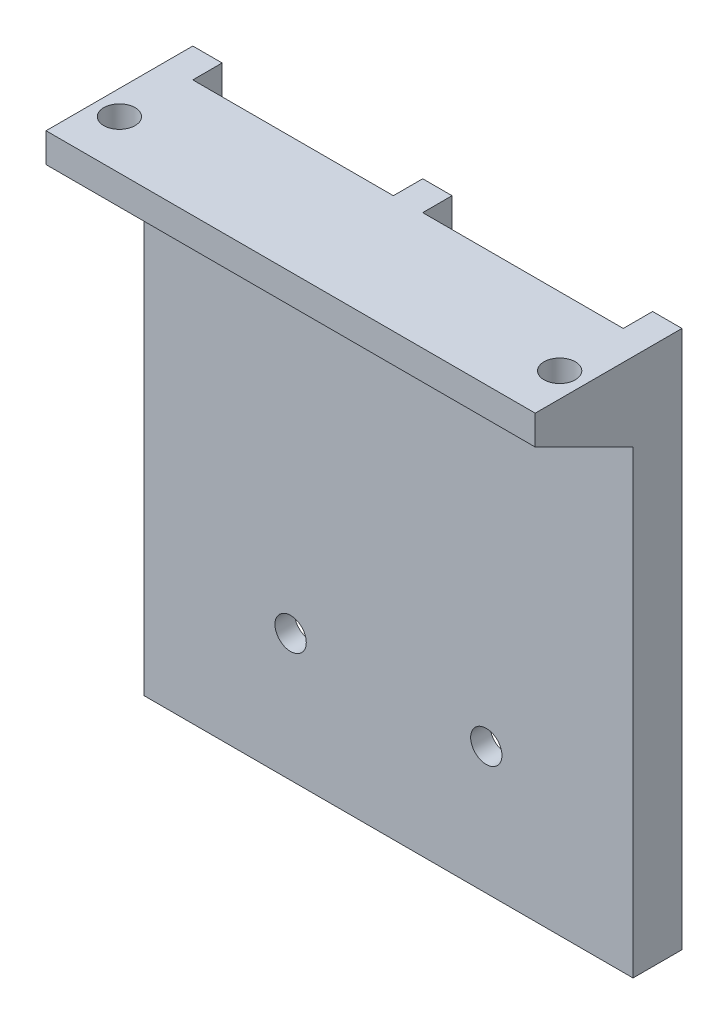
ISO-10303-21;
HEADER;
FILE_DESCRIPTION(('STEP AP214'),'2;1');
FILE_NAME('part.step','',(''),(''),'','','');
FILE_SCHEMA(('AUTOMOTIVE_DESIGN { 1 0 10303 214 1 1 1 1 }'));
ENDSEC;
DATA;
#1=APPLICATION_CONTEXT('core data for automotive mechanical design processes');
#2=APPLICATION_PROTOCOL_DEFINITION('international standard','automotive_design',2000,#1);
#3=PRODUCT_CONTEXT('',#1,'mechanical');
#4=PRODUCT('Part','Part','',(#3));
#5=PRODUCT_RELATED_PRODUCT_CATEGORY('part','',(#4));
#6=PRODUCT_DEFINITION_FORMATION('','',#4);
#7=PRODUCT_DEFINITION_CONTEXT('part definition',#1,'design');
#8=PRODUCT_DEFINITION('design','',#6,#7);
#9=PRODUCT_DEFINITION_SHAPE('','',#8);
#10=(LENGTH_UNIT() NAMED_UNIT(*) SI_UNIT(.MILLI.,.METRE.));
#11=(NAMED_UNIT(*) PLANE_ANGLE_UNIT() SI_UNIT($,.RADIAN.));
#12=(NAMED_UNIT(*) SI_UNIT($,.STERADIAN.) SOLID_ANGLE_UNIT());
#13=UNCERTAINTY_MEASURE_WITH_UNIT(LENGTH_MEASURE(1.E-05),#10,'distance_accuracy_value','');
#14=(GEOMETRIC_REPRESENTATION_CONTEXT(3) GLOBAL_UNCERTAINTY_ASSIGNED_CONTEXT((#13)) GLOBAL_UNIT_ASSIGNED_CONTEXT((#10,
#11,#12)) REPRESENTATION_CONTEXT('',''));
#15=CARTESIAN_POINT('',(0.,0.,0.));
#16=DIRECTION('',(0.,0.,1.));
#17=DIRECTION('',(1.,0.,0.));
#18=AXIS2_PLACEMENT_3D('',#15,#16,#17);
#19=CARTESIAN_POINT('',(0.,0.,-2.));
#20=DIRECTION('',(0.,0.,1.));
#21=DIRECTION('',(1.,0.,0.));
#22=AXIS2_PLACEMENT_3D('',#19,#20,#21);
#23=PLANE('',#22);
#24=CARTESIAN_POINT('',(10.,-46.9514892093612,-2.));
#25=DIRECTION('',(0.,0.,1.));
#26=DIRECTION('',(1.,0.,0.));
#27=AXIS2_PLACEMENT_3D('',#24,#25,#26);
#28=CIRCLE('',#27,1.6);
#29=CARTESIAN_POINT('',(11.6,-46.9514892093612,-2.));
#30=VERTEX_POINT('',#29);
#31=EDGE_CURVE('E251',#30,#30,#28,.T.);
#32=ORIENTED_EDGE('',*,*,#31,.T.);
#33=EDGE_LOOP('',(#32));
#34=FACE_BOUND('',#33,.T.);
#35=DIRECTION('',(0.,1.,0.));
#36=VECTOR('',#35,1.);
#37=CARTESIAN_POINT('',(22.,-59.9514892093612,-2.));
#38=LINE('',#37,#36);
#39=CARTESIAN_POINT('',(22.,-59.9514892093612,-2.));
#40=VERTEX_POINT('',#39);
#41=CARTESIAN_POINT('',(22.,-4.95148920936116,-2.));
#42=VERTEX_POINT('',#41);
#43=EDGE_CURVE('E49',#40,#42,#38,.T.);
#44=ORIENTED_EDGE('',*,*,#43,.F.);
#45=DIRECTION('',(1.,0.,0.));
#46=VECTOR('',#45,1.);
#47=CARTESIAN_POINT('',(-25.,-59.9514892093612,-2.));
#48=LINE('',#47,#46);
#49=CARTESIAN_POINT('',(1.5,-59.9514892093612,-2.));
#50=VERTEX_POINT('',#49);
#51=EDGE_CURVE('E258',#50,#40,#48,.T.);
#52=ORIENTED_EDGE('',*,*,#51,.F.);
#53=DIRECTION('',(0.,1.,0.));
#54=VECTOR('',#53,1.);
#55=CARTESIAN_POINT('',(1.5,0.,-2.));
#56=LINE('',#55,#54);
#57=CARTESIAN_POINT('',(1.5,-4.95148920936116,-2.));
#58=VERTEX_POINT('',#57);
#59=EDGE_CURVE('E134',#50,#58,#56,.T.);
#60=ORIENTED_EDGE('',*,*,#59,.T.);
#61=DIRECTION('',(-1.,0.,0.));
#62=VECTOR('',#61,1.);
#63=CARTESIAN_POINT('',(0.,-4.95148920936116,-2.));
#64=LINE('',#63,#62);
#65=EDGE_CURVE('E132',#42,#58,#64,.T.);
#66=ORIENTED_EDGE('',*,*,#65,.F.);
#67=EDGE_LOOP('',(#44,#52,#60,#66));
#68=FACE_BOUND('',#67,.T.);
#69=ADVANCED_FACE('F32',(#34,#68),#23,.F.);
#70=CARTESIAN_POINT('',(-10.,-46.9514892093612,-2.));
#71=DIRECTION('',(0.,0.,1.));
#72=DIRECTION('',(1.,0.,0.));
#73=AXIS2_PLACEMENT_3D('',#70,#71,#72);
#74=CIRCLE('',#73,1.6);
#75=CARTESIAN_POINT('',(-8.4,-46.9514892093612,-2.));
#76=VERTEX_POINT('',#75);
#77=EDGE_CURVE('E245',#76,#76,#74,.T.);
#78=ORIENTED_EDGE('',*,*,#77,.T.);
#79=EDGE_LOOP('',(#78));
#80=FACE_BOUND('',#79,.T.);
#81=CARTESIAN_POINT('',(-22.,-59.9514892093612,-2.));
#82=VERTEX_POINT('',#81);
#83=CARTESIAN_POINT('',(-1.5,-59.9514892093612,-2.));
#84=VERTEX_POINT('',#83);
#85=EDGE_CURVE('E257',#82,#84,#48,.T.);
#86=ORIENTED_EDGE('',*,*,#85,.F.);
#87=DIRECTION('',(0.,1.,0.));
#88=VECTOR('',#87,1.);
#89=CARTESIAN_POINT('',(-22.,0.,-2.));
#90=LINE('',#89,#88);
#91=CARTESIAN_POINT('',(-22.,-4.95148920936116,-2.));
#92=VERTEX_POINT('',#91);
#93=EDGE_CURVE('E57',#82,#92,#90,.T.);
#94=ORIENTED_EDGE('',*,*,#93,.T.);
#95=CARTESIAN_POINT('',(-1.5,-4.95148920936116,-2.));
#96=VERTEX_POINT('',#95);
#97=EDGE_CURVE('E140',#96,#92,#64,.T.);
#98=ORIENTED_EDGE('',*,*,#97,.F.);
#99=DIRECTION('',(0.,1.,0.));
#100=VECTOR('',#99,1.);
#101=CARTESIAN_POINT('',(-1.5,0.,-2.));
#102=LINE('',#101,#100);
#103=EDGE_CURVE('E186',#84,#96,#102,.T.);
#104=ORIENTED_EDGE('',*,*,#103,.F.);
#105=EDGE_LOOP('',(#86,#94,#98,#104));
#106=FACE_BOUND('',#105,.T.);
#107=ADVANCED_FACE('F306',(#80,#106),#23,.F.);
#108=CARTESIAN_POINT('',(-25.,-59.9514892093612,-2.));
#109=DIRECTION('',(-1.,0.,0.));
#110=DIRECTION('',(0.,0.,1.));
#111=AXIS2_PLACEMENT_3D('',#108,#109,#110);
#112=PLANE('',#111);
#113=DIRECTION('',(0.,-1.,0.));
#114=VECTOR('',#113,1.);
#115=CARTESIAN_POINT('',(-25.,-59.9514892093612,0.));
#116=LINE('',#115,#114);
#117=CARTESIAN_POINT('',(-25.,-12.9514892093612,0.));
#118=VERTEX_POINT('',#117);
#119=CARTESIAN_POINT('',(-25.,-59.9514892093612,0.));
#120=VERTEX_POINT('',#119);
#121=EDGE_CURVE('E254',#118,#120,#116,.T.);
#122=ORIENTED_EDGE('',*,*,#121,.F.);
#123=DIRECTION('',(0.,-0.447213595499958,-0.894427190999916));
#124=VECTOR('',#123,1.);
#125=CARTESIAN_POINT('',(-25.,-7.95148920936116,10.));
#126=LINE('',#125,#124);
#127=CARTESIAN_POINT('',(-25.,-7.95148920936116,10.));
#128=VERTEX_POINT('',#127);
#129=EDGE_CURVE('E226',#128,#118,#126,.T.);
#130=ORIENTED_EDGE('',*,*,#129,.F.);
#131=DIRECTION('',(0.,-1.,0.));
#132=VECTOR('',#131,1.);
#133=CARTESIAN_POINT('',(-25.,-4.95148920936116,10.));
#134=LINE('',#133,#132);
#135=CARTESIAN_POINT('',(-25.,-4.95148920936116,10.));
#136=VERTEX_POINT('',#135);
#137=EDGE_CURVE('E235',#136,#128,#134,.T.);
#138=ORIENTED_EDGE('',*,*,#137,.F.);
#139=DIRECTION('',(0.,0.,1.));
#140=VECTOR('',#139,1.);
#141=CARTESIAN_POINT('',(-25.,-4.95148920936116,-2.));
#142=LINE('',#141,#140);
#143=CARTESIAN_POINT('',(-25.,-4.95148920936116,-5.));
#144=VERTEX_POINT('',#143);
#145=EDGE_CURVE('E11',#144,#136,#142,.T.);
#146=ORIENTED_EDGE('',*,*,#145,.F.);
#147=DIRECTION('',(0.,1.,0.));
#148=VECTOR('',#147,1.);
#149=CARTESIAN_POINT('',(-25.,0.,-5.));
#150=LINE('',#149,#148);
#151=CARTESIAN_POINT('',(-25.,-59.9514892093612,-5.));
#152=VERTEX_POINT('',#151);
#153=EDGE_CURVE('E174',#152,#144,#150,.T.);
#154=ORIENTED_EDGE('',*,*,#153,.F.);
#155=DIRECTION('',(0.,0.,1.));
#156=VECTOR('',#155,1.);
#157=CARTESIAN_POINT('',(-25.,-59.9514892093612,-2.));
#158=LINE('',#157,#156);
#159=EDGE_CURVE('E139',#152,#120,#158,.T.);
#160=ORIENTED_EDGE('',*,*,#159,.T.);
#161=EDGE_LOOP('',(#122,#130,#138,#146,#154,#160));
#162=FACE_BOUND('',#161,.T.);
#163=ADVANCED_FACE('F34',(#162),#112,.T.);
#164=CARTESIAN_POINT('',(0.,-4.95148920936116,-2.));
#165=DIRECTION('',(0.,1.,0.));
#166=DIRECTION('',(-1.,0.,0.));
#167=AXIS2_PLACEMENT_3D('',#164,#165,#166);
#168=PLANE('',#167);
#169=CARTESIAN_POINT('',(-22.5,-4.95148920936116,5.));
#170=DIRECTION('',(0.,-1.,0.));
#171=DIRECTION('',(0.,0.,-1.));
#172=AXIS2_PLACEMENT_3D('',#169,#170,#171);
#173=CIRCLE('',#172,1.6);
#174=CARTESIAN_POINT('',(-22.5,-4.95148920936116,3.4));
#175=VERTEX_POINT('',#174);
#176=EDGE_CURVE('E219',#175,#175,#173,.T.);
#177=ORIENTED_EDGE('',*,*,#176,.T.);
#178=EDGE_LOOP('',(#177));
#179=FACE_BOUND('',#178,.T.);
#180=CARTESIAN_POINT('',(22.5,-4.95148920936116,5.));
#181=DIRECTION('',(0.,-1.,0.));
#182=DIRECTION('',(0.,0.,-1.));
#183=AXIS2_PLACEMENT_3D('',#180,#181,#182);
#184=CIRCLE('',#183,1.6);
#185=CARTESIAN_POINT('',(22.5,-4.95148920936116,3.4));
#186=VERTEX_POINT('',#185);
#187=EDGE_CURVE('E222',#186,#186,#184,.T.);
#188=ORIENTED_EDGE('',*,*,#187,.T.);
#189=EDGE_LOOP('',(#188));
#190=FACE_BOUND('',#189,.T.);
#191=ORIENTED_EDGE('',*,*,#145,.T.);
#192=DIRECTION('',(-1.,0.,0.));
#193=VECTOR('',#192,1.);
#194=CARTESIAN_POINT('',(25.,-4.95148920936116,10.));
#195=LINE('',#194,#193);
#196=CARTESIAN_POINT('',(25.,-4.95148920936116,10.));
#197=VERTEX_POINT('',#196);
#198=EDGE_CURVE('E232',#197,#136,#195,.T.);
#199=ORIENTED_EDGE('',*,*,#198,.F.);
#200=DIRECTION('',(0.,0.,1.));
#201=VECTOR('',#200,1.);
#202=CARTESIAN_POINT('',(25.,-4.95148920936116,-2.));
#203=LINE('',#202,#201);
#204=CARTESIAN_POINT('',(25.,-4.95148920936116,-5.));
#205=VERTEX_POINT('',#204);
#206=EDGE_CURVE('E41',#205,#197,#203,.T.);
#207=ORIENTED_EDGE('',*,*,#206,.F.);
#208=DIRECTION('',(1.,0.,0.));
#209=VECTOR('',#208,1.);
#210=CARTESIAN_POINT('',(22.,-4.95148920936116,-5.));
#211=LINE('',#210,#209);
#212=CARTESIAN_POINT('',(22.,-4.95148920936116,-5.));
#213=VERTEX_POINT('',#212);
#214=EDGE_CURVE('E152',#213,#205,#211,.T.);
#215=ORIENTED_EDGE('',*,*,#214,.F.);
#216=DIRECTION('',(0.,0.,1.));
#217=VECTOR('',#216,1.);
#218=CARTESIAN_POINT('',(22.,-4.95148920936116,-5.));
#219=LINE('',#218,#217);
#220=EDGE_CURVE('E147',#213,#42,#219,.T.);
#221=ORIENTED_EDGE('',*,*,#220,.T.);
#222=ORIENTED_EDGE('',*,*,#65,.T.);
#223=DIRECTION('',(0.,0.,1.));
#224=VECTOR('',#223,1.);
#225=CARTESIAN_POINT('',(1.5,-4.95148920936116,-5.));
#226=LINE('',#225,#224);
#227=CARTESIAN_POINT('',(1.5,-4.95148920936116,-5.));
#228=VERTEX_POINT('',#227);
#229=EDGE_CURVE('E192',#228,#58,#226,.T.);
#230=ORIENTED_EDGE('',*,*,#229,.F.);
#231=DIRECTION('',(1.,0.,0.));
#232=VECTOR('',#231,1.);
#233=CARTESIAN_POINT('',(0.,-4.95148920936116,-5.));
#234=LINE('',#233,#232);
#235=CARTESIAN_POINT('',(-1.5,-4.95148920936116,-5.));
#236=VERTEX_POINT('',#235);
#237=EDGE_CURVE('E190',#236,#228,#234,.T.);
#238=ORIENTED_EDGE('',*,*,#237,.F.);
#239=DIRECTION('',(0.,0.,1.));
#240=VECTOR('',#239,1.);
#241=CARTESIAN_POINT('',(-1.5,-4.95148920936116,-5.));
#242=LINE('',#241,#240);
#243=EDGE_CURVE('E197',#236,#96,#242,.T.);
#244=ORIENTED_EDGE('',*,*,#243,.T.);
#245=ORIENTED_EDGE('',*,*,#97,.T.);
#246=DIRECTION('',(0.,0.,1.));
#247=VECTOR('',#246,1.);
#248=CARTESIAN_POINT('',(-22.,-4.95148920936116,-5.));
#249=LINE('',#248,#247);
#250=CARTESIAN_POINT('',(-22.,-4.95148920936116,-5.));
#251=VERTEX_POINT('',#250);
#252=EDGE_CURVE('E168',#251,#92,#249,.T.);
#253=ORIENTED_EDGE('',*,*,#252,.F.);
#254=DIRECTION('',(1.,0.,0.));
#255=VECTOR('',#254,1.);
#256=CARTESIAN_POINT('',(0.,-4.95148920936116,-5.));
#257=LINE('',#256,#255);
#258=EDGE_CURVE('E170',#144,#251,#257,.T.);
#259=ORIENTED_EDGE('',*,*,#258,.F.);
#260=EDGE_LOOP('',(#191,#199,#207,#215,#221,#222,#230,#238,#244,#245,#253,#259));
#261=FACE_BOUND('',#260,.T.);
#262=ADVANCED_FACE('F154',(#179,#190,#261),#168,.T.);
#263=CARTESIAN_POINT('',(25.,-4.95148920936116,-2.));
#264=DIRECTION('',(1.,0.,0.));
#265=DIRECTION('',(0.,1.,0.));
#266=AXIS2_PLACEMENT_3D('',#263,#264,#265);
#267=PLANE('',#266);
#268=DIRECTION('',(0.,1.,0.));
#269=VECTOR('',#268,1.);
#270=CARTESIAN_POINT('',(25.,-4.95148920936116,0.));
#271=LINE('',#270,#269);
#272=CARTESIAN_POINT('',(25.,-59.9514892093612,0.));
#273=VERTEX_POINT('',#272);
#274=CARTESIAN_POINT('',(25.,-12.9514892093612,0.));
#275=VERTEX_POINT('',#274);
#276=EDGE_CURVE('E264',#273,#275,#271,.T.);
#277=ORIENTED_EDGE('',*,*,#276,.F.);
#278=DIRECTION('',(0.,0.,1.));
#279=VECTOR('',#278,1.);
#280=CARTESIAN_POINT('',(25.,-59.9514892093612,-2.));
#281=LINE('',#280,#279);
#282=CARTESIAN_POINT('',(25.,-59.9514892093612,-5.));
#283=VERTEX_POINT('',#282);
#284=EDGE_CURVE('E268',#283,#273,#281,.T.);
#285=ORIENTED_EDGE('',*,*,#284,.F.);
#286=DIRECTION('',(0.,-1.,0.));
#287=VECTOR('',#286,1.);
#288=CARTESIAN_POINT('',(25.,-4.95148920936116,-5.));
#289=LINE('',#288,#287);
#290=EDGE_CURVE('E163',#205,#283,#289,.T.);
#291=ORIENTED_EDGE('',*,*,#290,.F.);
#292=ORIENTED_EDGE('',*,*,#206,.T.);
#293=DIRECTION('',(0.,1.,0.));
#294=VECTOR('',#293,1.);
#295=CARTESIAN_POINT('',(25.,-7.95148920936116,10.));
#296=LINE('',#295,#294);
#297=CARTESIAN_POINT('',(25.,-7.95148920936116,10.));
#298=VERTEX_POINT('',#297);
#299=EDGE_CURVE('E241',#298,#197,#296,.T.);
#300=ORIENTED_EDGE('',*,*,#299,.F.);
#301=DIRECTION('',(0.,-0.447213595499958,-0.894427190999916));
#302=VECTOR('',#301,1.);
#303=CARTESIAN_POINT('',(25.,-7.95148920936116,10.));
#304=LINE('',#303,#302);
#305=EDGE_CURVE('E225',#298,#275,#304,.T.);
#306=ORIENTED_EDGE('',*,*,#305,.T.);
#307=EDGE_LOOP('',(#277,#285,#291,#292,#300,#306));
#308=FACE_BOUND('',#307,.T.);
#309=ADVANCED_FACE('F324',(#308),#267,.T.);
#310=CARTESIAN_POINT('',(-25.,-59.9514892093612,-2.));
#311=DIRECTION('',(0.,-1.,0.));
#312=DIRECTION('',(0.,0.,-1.));
#313=AXIS2_PLACEMENT_3D('',#310,#311,#312);
#314=PLANE('',#313);
#315=DIRECTION('',(1.,0.,0.));
#316=VECTOR('',#315,1.);
#317=CARTESIAN_POINT('',(-25.,-59.9514892093612,0.));
#318=LINE('',#317,#316);
#319=EDGE_CURVE('E261',#120,#273,#318,.T.);
#320=ORIENTED_EDGE('',*,*,#319,.F.);
#321=ORIENTED_EDGE('',*,*,#159,.F.);
#322=DIRECTION('',(-1.,0.,0.));
#323=VECTOR('',#322,1.);
#324=CARTESIAN_POINT('',(0.,-59.9514892093612,-5.));
#325=LINE('',#324,#323);
#326=CARTESIAN_POINT('',(-22.,-59.9514892093612,-5.));
#327=VERTEX_POINT('',#326);
#328=EDGE_CURVE('E177',#327,#152,#325,.T.);
#329=ORIENTED_EDGE('',*,*,#328,.F.);
#330=DIRECTION('',(0.,0.,1.));
#331=VECTOR('',#330,1.);
#332=CARTESIAN_POINT('',(-22.,-59.9514892093612,-5.));
#333=LINE('',#332,#331);
#334=EDGE_CURVE('E151',#327,#82,#333,.T.);
#335=ORIENTED_EDGE('',*,*,#334,.T.);
#336=ORIENTED_EDGE('',*,*,#85,.T.);
#337=DIRECTION('',(0.,0.,1.));
#338=VECTOR('',#337,1.);
#339=CARTESIAN_POINT('',(-1.5,-59.9514892093612,-5.));
#340=LINE('',#339,#338);
#341=CARTESIAN_POINT('',(-1.5,-59.9514892093612,-5.));
#342=VERTEX_POINT('',#341);
#343=EDGE_CURVE('E200',#342,#84,#340,.T.);
#344=ORIENTED_EDGE('',*,*,#343,.F.);
#345=DIRECTION('',(-1.,0.,0.));
#346=VECTOR('',#345,1.);
#347=CARTESIAN_POINT('',(0.,-59.9514892093612,-5.));
#348=LINE('',#347,#346);
#349=CARTESIAN_POINT('',(1.5,-59.9514892093612,-5.));
#350=VERTEX_POINT('',#349);
#351=EDGE_CURVE('E185',#350,#342,#348,.T.);
#352=ORIENTED_EDGE('',*,*,#351,.F.);
#353=DIRECTION('',(0.,0.,1.));
#354=VECTOR('',#353,1.);
#355=CARTESIAN_POINT('',(1.5,-59.9514892093612,-5.));
#356=LINE('',#355,#354);
#357=EDGE_CURVE('E203',#350,#50,#356,.T.);
#358=ORIENTED_EDGE('',*,*,#357,.T.);
#359=ORIENTED_EDGE('',*,*,#51,.T.);
#360=DIRECTION('',(0.,0.,1.));
#361=VECTOR('',#360,1.);
#362=CARTESIAN_POINT('',(22.,-59.9514892093612,-5.));
#363=LINE('',#362,#361);
#364=CARTESIAN_POINT('',(22.,-59.9514892093612,-5.));
#365=VERTEX_POINT('',#364);
#366=EDGE_CURVE('E150',#365,#40,#363,.T.);
#367=ORIENTED_EDGE('',*,*,#366,.F.);
#368=DIRECTION('',(-1.,0.,0.));
#369=VECTOR('',#368,1.);
#370=CARTESIAN_POINT('',(25.,-59.9514892093612,-5.));
#371=LINE('',#370,#369);
#372=EDGE_CURVE('E158',#283,#365,#371,.T.);
#373=ORIENTED_EDGE('',*,*,#372,.F.);
#374=ORIENTED_EDGE('',*,*,#284,.T.);
#375=EDGE_LOOP('',(#320,#321,#329,#335,#336,#344,#352,#358,#359,#367,#373,#374));
#376=FACE_BOUND('',#375,.T.);
#377=ADVANCED_FACE('F320',(#376),#314,.T.);
#378=CARTESIAN_POINT('',(0.,0.,0.));
#379=DIRECTION('',(0.,0.,1.));
#380=DIRECTION('',(1.,0.,0.));
#381=AXIS2_PLACEMENT_3D('',#378,#379,#380);
#382=PLANE('',#381);
#383=DIRECTION('',(1.,0.,0.));
#384=VECTOR('',#383,1.);
#385=CARTESIAN_POINT('',(-25.,-12.9514892093612,0.));
#386=LINE('',#385,#384);
#387=EDGE_CURVE('E228',#118,#275,#386,.T.);
#388=ORIENTED_EDGE('',*,*,#387,.F.);
#389=ORIENTED_EDGE('',*,*,#121,.T.);
#390=ORIENTED_EDGE('',*,*,#319,.T.);
#391=ORIENTED_EDGE('',*,*,#276,.T.);
#392=EDGE_LOOP('',(#388,#389,#390,#391));
#393=FACE_BOUND('',#392,.T.);
#394=CARTESIAN_POINT('',(-10.,-46.9514892093612,0.));
#395=DIRECTION('',(0.,0.,1.));
#396=DIRECTION('',(1.,0.,0.));
#397=AXIS2_PLACEMENT_3D('',#394,#395,#396);
#398=CIRCLE('',#397,1.6);
#399=CARTESIAN_POINT('',(-8.4,-46.9514892093612,0.));
#400=VERTEX_POINT('',#399);
#401=EDGE_CURVE('E244',#400,#400,#398,.T.);
#402=ORIENTED_EDGE('',*,*,#401,.F.);
#403=EDGE_LOOP('',(#402));
#404=FACE_BOUND('',#403,.T.);
#405=CARTESIAN_POINT('',(10.,-46.9514892093612,0.));
#406=DIRECTION('',(0.,0.,1.));
#407=DIRECTION('',(1.,0.,0.));
#408=AXIS2_PLACEMENT_3D('',#405,#406,#407);
#409=CIRCLE('',#408,1.6);
#410=CARTESIAN_POINT('',(11.6,-46.9514892093612,0.));
#411=VERTEX_POINT('',#410);
#412=EDGE_CURVE('E248',#411,#411,#409,.T.);
#413=ORIENTED_EDGE('',*,*,#412,.F.);
#414=EDGE_LOOP('',(#413));
#415=FACE_BOUND('',#414,.T.);
#416=ADVANCED_FACE('F317',(#393,#404,#415),#382,.T.);
#417=CARTESIAN_POINT('',(10.,-46.9514892093612,-2.));
#418=DIRECTION('',(0.,0.,1.));
#419=DIRECTION('',(1.,0.,0.));
#420=AXIS2_PLACEMENT_3D('',#417,#418,#419);
#421=CYLINDRICAL_SURFACE('',#420,1.6);
#422=ORIENTED_EDGE('',*,*,#31,.F.);
#423=EDGE_LOOP('',(#422));
#424=FACE_BOUND('',#423,.T.);
#425=ORIENTED_EDGE('',*,*,#412,.T.);
#426=EDGE_LOOP('',(#425));
#427=FACE_BOUND('',#426,.T.);
#428=ADVANCED_FACE('F315',(#424,#427),#421,.F.);
#429=CARTESIAN_POINT('',(-10.,-46.9514892093612,-2.));
#430=DIRECTION('',(0.,0.,1.));
#431=DIRECTION('',(1.,0.,0.));
#432=AXIS2_PLACEMENT_3D('',#429,#430,#431);
#433=CYLINDRICAL_SURFACE('',#432,1.6);
#434=ORIENTED_EDGE('',*,*,#77,.F.);
#435=EDGE_LOOP('',(#434));
#436=FACE_BOUND('',#435,.T.);
#437=ORIENTED_EDGE('',*,*,#401,.T.);
#438=EDGE_LOOP('',(#437));
#439=FACE_BOUND('',#438,.T.);
#440=ADVANCED_FACE('F491',(#436,#439),#433,.F.);
#441=CARTESIAN_POINT('',(0.,0.,10.));
#442=DIRECTION('',(0.,0.,1.));
#443=DIRECTION('',(1.,0.,0.));
#444=AXIS2_PLACEMENT_3D('',#441,#442,#443);
#445=PLANE('',#444);
#446=ORIENTED_EDGE('',*,*,#198,.T.);
#447=ORIENTED_EDGE('',*,*,#137,.T.);
#448=DIRECTION('',(1.,0.,0.));
#449=VECTOR('',#448,1.);
#450=CARTESIAN_POINT('',(-25.,-7.95148920936116,10.));
#451=LINE('',#450,#449);
#452=EDGE_CURVE('E238',#128,#298,#451,.T.);
#453=ORIENTED_EDGE('',*,*,#452,.T.);
#454=ORIENTED_EDGE('',*,*,#299,.T.);
#455=EDGE_LOOP('',(#446,#447,#453,#454));
#456=FACE_BOUND('',#455,.T.);
#457=ADVANCED_FACE('F301',(#456),#445,.T.);
#458=CARTESIAN_POINT('',(-25.,-7.95148920936116,10.));
#459=DIRECTION('',(0.,-0.894427190999916,0.447213595499958));
#460=DIRECTION('',(0.,-0.447213595499958,-0.894427190999916));
#461=AXIS2_PLACEMENT_3D('',#458,#459,#460);
#462=PLANE('',#461);
#463=CARTESIAN_POINT('',(-22.5,-10.4514892093612,5.));
#464=DIRECTION('',(0.,-0.894427190999916,0.447213595499958));
#465=DIRECTION('',(0.,0.447213595499958,0.894427190999916));
#466=AXIS2_PLACEMENT_3D('',#463,#464,#465);
#467=ELLIPSE('',#466,2.57147817412476,2.3);
#468=CARTESIAN_POINT('',(-22.5,-9.30148920936116,7.3));
#469=VERTEX_POINT('',#468);
#470=EDGE_CURVE('E36',#469,#469,#467,.F.);
#471=ORIENTED_EDGE('',*,*,#470,.T.);
#472=EDGE_LOOP('',(#471));
#473=FACE_BOUND('',#472,.T.);
#474=CARTESIAN_POINT('',(22.5,-10.4514892093612,5.));
#475=DIRECTION('',(0.,-0.894427190999916,0.447213595499958));
#476=DIRECTION('',(0.,0.447213595499958,0.894427190999916));
#477=AXIS2_PLACEMENT_3D('',#474,#475,#476);
#478=ELLIPSE('',#477,2.57147817412476,2.3);
#479=CARTESIAN_POINT('',(22.5,-9.30148920936116,7.3));
#480=VERTEX_POINT('',#479);
#481=EDGE_CURVE('E218',#480,#480,#478,.F.);
#482=ORIENTED_EDGE('',*,*,#481,.T.);
#483=EDGE_LOOP('',(#482));
#484=FACE_BOUND('',#483,.T.);
#485=ORIENTED_EDGE('',*,*,#305,.F.);
#486=ORIENTED_EDGE('',*,*,#452,.F.);
#487=ORIENTED_EDGE('',*,*,#129,.T.);
#488=ORIENTED_EDGE('',*,*,#387,.T.);
#489=EDGE_LOOP('',(#485,#486,#487,#488));
#490=FACE_BOUND('',#489,.T.);
#491=ADVANCED_FACE('F274',(#473,#484,#490),#462,.T.);
#492=CARTESIAN_POINT('',(22.5,-4.95148920936116,5.));
#493=DIRECTION('',(0.,-1.,0.));
#494=DIRECTION('',(0.,0.,-1.));
#495=AXIS2_PLACEMENT_3D('',#492,#493,#494);
#496=CYLINDRICAL_SURFACE('',#495,1.6);
#497=ORIENTED_EDGE('',*,*,#187,.F.);
#498=EDGE_LOOP('',(#497));
#499=FACE_BOUND('',#498,.T.);
#500=CARTESIAN_POINT('',(22.5,-7.95148920936116,5.));
#501=DIRECTION('',(0.,-1.,0.));
#502=DIRECTION('',(0.,0.,-1.));
#503=AXIS2_PLACEMENT_3D('',#500,#501,#502);
#504=CIRCLE('',#503,1.6);
#505=CARTESIAN_POINT('',(22.5,-7.95148920936116,3.4));
#506=VERTEX_POINT('',#505);
#507=EDGE_CURVE('E215',#506,#506,#504,.F.);
#508=ORIENTED_EDGE('',*,*,#507,.F.);
#509=EDGE_LOOP('',(#508));
#510=FACE_BOUND('',#509,.T.);
#511=ADVANCED_FACE('F291',(#499,#510),#496,.F.);
#512=CARTESIAN_POINT('',(-22.5,-4.95148920936116,5.));
#513=DIRECTION('',(0.,-1.,0.));
#514=DIRECTION('',(0.,0.,-1.));
#515=AXIS2_PLACEMENT_3D('',#512,#513,#514);
#516=CYLINDRICAL_SURFACE('',#515,1.6);
#517=ORIENTED_EDGE('',*,*,#176,.F.);
#518=EDGE_LOOP('',(#517));
#519=FACE_BOUND('',#518,.T.);
#520=CARTESIAN_POINT('',(-22.5,-7.95148920936116,5.));
#521=DIRECTION('',(0.,-1.,0.));
#522=DIRECTION('',(0.,0.,-1.));
#523=AXIS2_PLACEMENT_3D('',#520,#521,#522);
#524=CIRCLE('',#523,1.6);
#525=CARTESIAN_POINT('',(-22.5,-7.95148920936116,3.4));
#526=VERTEX_POINT('',#525);
#527=EDGE_CURVE('E209',#526,#526,#524,.F.);
#528=ORIENTED_EDGE('',*,*,#527,.F.);
#529=EDGE_LOOP('',(#528));
#530=FACE_BOUND('',#529,.T.);
#531=ADVANCED_FACE('F287',(#519,#530),#516,.F.);
#532=CARTESIAN_POINT('',(22.5,-7.95148920936116,5.));
#533=DIRECTION('',(0.,-1.,0.));
#534=DIRECTION('',(0.,0.,-1.));
#535=AXIS2_PLACEMENT_3D('',#532,#533,#534);
#536=PLANE('',#535);
#537=CARTESIAN_POINT('',(22.5,-7.95148920936116,5.));
#538=DIRECTION('',(0.,-1.,0.));
#539=DIRECTION('',(0.,0.,-1.));
#540=AXIS2_PLACEMENT_3D('',#537,#538,#539);
#541=CIRCLE('',#540,2.3);
#542=CARTESIAN_POINT('',(22.5,-7.95148920936116,2.7));
#543=VERTEX_POINT('',#542);
#544=EDGE_CURVE('E212',#543,#543,#541,.T.);
#545=ORIENTED_EDGE('',*,*,#544,.T.);
#546=EDGE_LOOP('',(#545));
#547=FACE_BOUND('',#546,.T.);
#548=ORIENTED_EDGE('',*,*,#507,.T.);
#549=EDGE_LOOP('',(#548));
#550=FACE_BOUND('',#549,.T.);
#551=ADVANCED_FACE('F281',(#547,#550),#536,.T.);
#552=CARTESIAN_POINT('',(22.5,-27.9514892093612,5.));
#553=DIRECTION('',(0.,1.,0.));
#554=DIRECTION('',(0.,0.,1.));
#555=AXIS2_PLACEMENT_3D('',#552,#553,#554);
#556=CYLINDRICAL_SURFACE('',#555,2.3);
#557=ORIENTED_EDGE('',*,*,#481,.F.);
#558=EDGE_LOOP('',(#557));
#559=FACE_BOUND('',#558,.T.);
#560=ORIENTED_EDGE('',*,*,#544,.F.);
#561=EDGE_LOOP('',(#560));
#562=FACE_BOUND('',#561,.T.);
#563=ADVANCED_FACE('F277',(#559,#562),#556,.F.);
#564=CARTESIAN_POINT('',(-22.5,-7.95148920936116,5.));
#565=DIRECTION('',(0.,-1.,0.));
#566=DIRECTION('',(0.,0.,-1.));
#567=AXIS2_PLACEMENT_3D('',#564,#565,#566);
#568=PLANE('',#567);
#569=CARTESIAN_POINT('',(-22.5,-7.95148920936116,5.));
#570=DIRECTION('',(0.,-1.,0.));
#571=DIRECTION('',(0.,0.,-1.));
#572=AXIS2_PLACEMENT_3D('',#569,#570,#571);
#573=CIRCLE('',#572,2.3);
#574=CARTESIAN_POINT('',(-22.5,-7.95148920936116,2.7));
#575=VERTEX_POINT('',#574);
#576=EDGE_CURVE('E206',#575,#575,#573,.T.);
#577=ORIENTED_EDGE('',*,*,#576,.T.);
#578=EDGE_LOOP('',(#577));
#579=FACE_BOUND('',#578,.T.);
#580=ORIENTED_EDGE('',*,*,#527,.T.);
#581=EDGE_LOOP('',(#580));
#582=FACE_BOUND('',#581,.T.);
#583=ADVANCED_FACE('F280',(#579,#582),#568,.T.);
#584=CARTESIAN_POINT('',(-22.5,-27.9514892093612,5.));
#585=DIRECTION('',(0.,1.,0.));
#586=DIRECTION('',(0.,0.,1.));
#587=AXIS2_PLACEMENT_3D('',#584,#585,#586);
#588=CYLINDRICAL_SURFACE('',#587,2.3);
#589=ORIENTED_EDGE('',*,*,#470,.F.);
#590=EDGE_LOOP('',(#589));
#591=FACE_BOUND('',#590,.T.);
#592=ORIENTED_EDGE('',*,*,#576,.F.);
#593=EDGE_LOOP('',(#592));
#594=FACE_BOUND('',#593,.T.);
#595=ADVANCED_FACE('F367',(#591,#594),#588,.F.);
#596=CARTESIAN_POINT('',(1.5,0.,-5.));
#597=DIRECTION('',(1.,0.,0.));
#598=DIRECTION('',(0.,0.,-1.));
#599=AXIS2_PLACEMENT_3D('',#596,#597,#598);
#600=PLANE('',#599);
#601=ORIENTED_EDGE('',*,*,#59,.F.);
#602=ORIENTED_EDGE('',*,*,#357,.F.);
#603=DIRECTION('',(0.,1.,0.));
#604=VECTOR('',#603,1.);
#605=CARTESIAN_POINT('',(1.5,0.,-5.));
#606=LINE('',#605,#604);
#607=EDGE_CURVE('E182',#350,#228,#606,.T.);
#608=ORIENTED_EDGE('',*,*,#607,.T.);
#609=ORIENTED_EDGE('',*,*,#229,.T.);
#610=EDGE_LOOP('',(#601,#602,#608,#609));
#611=FACE_BOUND('',#610,.T.);
#612=ADVANCED_FACE('F365',(#611),#600,.T.);
#613=CARTESIAN_POINT('',(-1.5,0.,-5.));
#614=DIRECTION('',(1.,0.,0.));
#615=DIRECTION('',(0.,0.,-1.));
#616=AXIS2_PLACEMENT_3D('',#613,#614,#615);
#617=PLANE('',#616);
#618=ORIENTED_EDGE('',*,*,#103,.T.);
#619=ORIENTED_EDGE('',*,*,#243,.F.);
#620=DIRECTION('',(0.,1.,0.));
#621=VECTOR('',#620,1.);
#622=CARTESIAN_POINT('',(-1.5,0.,-5.));
#623=LINE('',#622,#621);
#624=EDGE_CURVE('E188',#342,#236,#623,.T.);
#625=ORIENTED_EDGE('',*,*,#624,.F.);
#626=ORIENTED_EDGE('',*,*,#343,.T.);
#627=EDGE_LOOP('',(#618,#619,#625,#626));
#628=FACE_BOUND('',#627,.T.);
#629=ADVANCED_FACE('F358',(#628),#617,.F.);
#630=CARTESIAN_POINT('',(0.,0.,-5.));
#631=DIRECTION('',(0.,0.,-1.));
#632=DIRECTION('',(-1.,0.,0.));
#633=AXIS2_PLACEMENT_3D('',#630,#631,#632);
#634=PLANE('',#633);
#635=ORIENTED_EDGE('',*,*,#607,.F.);
#636=ORIENTED_EDGE('',*,*,#351,.T.);
#637=ORIENTED_EDGE('',*,*,#624,.T.);
#638=ORIENTED_EDGE('',*,*,#237,.T.);
#639=EDGE_LOOP('',(#635,#636,#637,#638));
#640=FACE_BOUND('',#639,.T.);
#641=ADVANCED_FACE('F362',(#640),#634,.T.);
#642=CARTESIAN_POINT('',(-22.,0.,-5.));
#643=DIRECTION('',(1.,0.,0.));
#644=DIRECTION('',(0.,0.,-1.));
#645=AXIS2_PLACEMENT_3D('',#642,#643,#644);
#646=PLANE('',#645);
#647=ORIENTED_EDGE('',*,*,#93,.F.);
#648=ORIENTED_EDGE('',*,*,#334,.F.);
#649=DIRECTION('',(0.,1.,0.));
#650=VECTOR('',#649,1.);
#651=CARTESIAN_POINT('',(-22.,0.,-5.));
#652=LINE('',#651,#650);
#653=EDGE_CURVE('E172',#327,#251,#652,.T.);
#654=ORIENTED_EDGE('',*,*,#653,.T.);
#655=ORIENTED_EDGE('',*,*,#252,.T.);
#656=EDGE_LOOP('',(#647,#648,#654,#655));
#657=FACE_BOUND('',#656,.T.);
#658=ADVANCED_FACE('F350',(#657),#646,.T.);
#659=CARTESIAN_POINT('',(0.,0.,-5.));
#660=DIRECTION('',(0.,0.,-1.));
#661=DIRECTION('',(-1.,0.,0.));
#662=AXIS2_PLACEMENT_3D('',#659,#660,#661);
#663=PLANE('',#662);
#664=ORIENTED_EDGE('',*,*,#653,.F.);
#665=ORIENTED_EDGE('',*,*,#328,.T.);
#666=ORIENTED_EDGE('',*,*,#153,.T.);
#667=ORIENTED_EDGE('',*,*,#258,.T.);
#668=EDGE_LOOP('',(#664,#665,#666,#667));
#669=FACE_BOUND('',#668,.T.);
#670=ADVANCED_FACE('F346',(#669),#663,.T.);
#671=CARTESIAN_POINT('',(22.,-59.9514892093612,-5.));
#672=DIRECTION('',(1.,0.,0.));
#673=DIRECTION('',(0.,0.,-1.));
#674=AXIS2_PLACEMENT_3D('',#671,#672,#673);
#675=PLANE('',#674);
#676=ORIENTED_EDGE('',*,*,#43,.T.);
#677=ORIENTED_EDGE('',*,*,#220,.F.);
#678=DIRECTION('',(0.,1.,0.));
#679=VECTOR('',#678,1.);
#680=CARTESIAN_POINT('',(22.,-59.9514892093612,-5.));
#681=LINE('',#680,#679);
#682=EDGE_CURVE('E156',#365,#213,#681,.T.);
#683=ORIENTED_EDGE('',*,*,#682,.F.);
#684=ORIENTED_EDGE('',*,*,#366,.T.);
#685=EDGE_LOOP('',(#676,#677,#683,#684));
#686=FACE_BOUND('',#685,.T.);
#687=ADVANCED_FACE('F145',(#686),#675,.F.);
#688=CARTESIAN_POINT('',(0.,0.,-5.));
#689=DIRECTION('',(0.,0.,-1.));
#690=DIRECTION('',(-1.,0.,0.));
#691=AXIS2_PLACEMENT_3D('',#688,#689,#690);
#692=PLANE('',#691);
#693=ORIENTED_EDGE('',*,*,#214,.T.);
#694=ORIENTED_EDGE('',*,*,#290,.T.);
#695=ORIENTED_EDGE('',*,*,#372,.T.);
#696=ORIENTED_EDGE('',*,*,#682,.T.);
#697=EDGE_LOOP('',(#693,#694,#695,#696));
#698=FACE_BOUND('',#697,.T.);
#699=ADVANCED_FACE('F474',(#698),#692,.T.);
#700=CLOSED_SHELL('',(#69,#107,#163,#262,#309,#377,#416,#428,#440,#457,#491,#511,#531,#551,#563,
#583,#595,#612,#629,#641,#658,#670,#687,#699));
#701=MANIFOLD_SOLID_BREP('B2',#700);
#702=ADVANCED_BREP_SHAPE_REPRESENTATION('',(#18,#701),#14);
#703=SHAPE_DEFINITION_REPRESENTATION(#9,#702);
ENDSEC;
END-ISO-10303-21;
